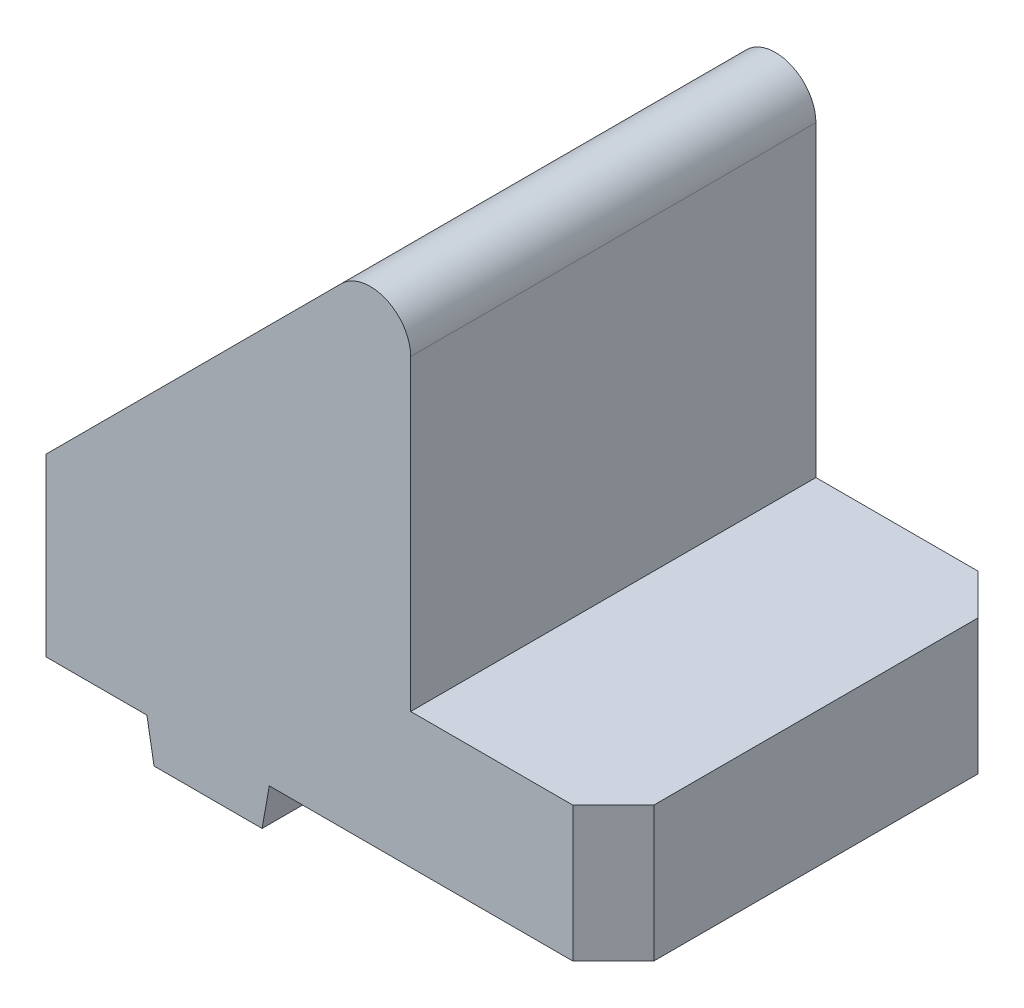
ISO-10303-21;
HEADER;
FILE_DESCRIPTION(('STEP AP214'),'2;1');
FILE_NAME('part.step','',(''),(''),'','','');
FILE_SCHEMA(('AUTOMOTIVE_DESIGN { 1 0 10303 214 1 1 1 1 }'));
ENDSEC;
DATA;
#1=APPLICATION_CONTEXT('core data for automotive mechanical design processes');
#2=APPLICATION_PROTOCOL_DEFINITION('international standard','automotive_design',2000,#1);
#3=PRODUCT_CONTEXT('',#1,'mechanical');
#4=PRODUCT('Part','Part','',(#3));
#5=PRODUCT_RELATED_PRODUCT_CATEGORY('part','',(#4));
#6=PRODUCT_DEFINITION_FORMATION('','',#4);
#7=PRODUCT_DEFINITION_CONTEXT('part definition',#1,'design');
#8=PRODUCT_DEFINITION('design','',#6,#7);
#9=PRODUCT_DEFINITION_SHAPE('','',#8);
#10=(LENGTH_UNIT() NAMED_UNIT(*) SI_UNIT(.MILLI.,.METRE.));
#11=(NAMED_UNIT(*) PLANE_ANGLE_UNIT() SI_UNIT($,.RADIAN.));
#12=(NAMED_UNIT(*) SI_UNIT($,.STERADIAN.) SOLID_ANGLE_UNIT());
#13=UNCERTAINTY_MEASURE_WITH_UNIT(LENGTH_MEASURE(1.E-05),#10,'distance_accuracy_value','');
#14=(GEOMETRIC_REPRESENTATION_CONTEXT(3) GLOBAL_UNCERTAINTY_ASSIGNED_CONTEXT((#13)) GLOBAL_UNIT_ASSIGNED_CONTEXT((#10,
#11,#12)) REPRESENTATION_CONTEXT('',''));
#15=CARTESIAN_POINT('',(0.,0.,0.));
#16=DIRECTION('',(0.,0.,1.));
#17=DIRECTION('',(1.,0.,0.));
#18=AXIS2_PLACEMENT_3D('',#15,#16,#17);
#19=CARTESIAN_POINT('',(15.,0.,15.));
#20=DIRECTION('',(0.,1.,0.));
#21=DIRECTION('',(-1.,0.,0.));
#22=AXIS2_PLACEMENT_3D('',#19,#20,#21);
#23=PLANE('',#22);
#24=DIRECTION('',(1.,0.,0.));
#25=VECTOR('',#24,1.);
#26=CARTESIAN_POINT('',(15.,0.,-15.));
#27=LINE('',#26,#25);
#28=CARTESIAN_POINT('',(-10.4710190578746,0.,-15.));
#29=VERTEX_POINT('',#28);
#30=CARTESIAN_POINT('',(12.,0.,-15.));
#31=VERTEX_POINT('',#30);
#32=EDGE_CURVE('E240',#29,#31,#27,.T.);
#33=ORIENTED_EDGE('',*,*,#32,.T.);
#34=DIRECTION('',(0.707106781186548,0.,0.707106781186547));
#35=VECTOR('',#34,1.);
#36=CARTESIAN_POINT('',(15.,0.,-12.));
#37=LINE('',#36,#35);
#38=CARTESIAN_POINT('',(15.,0.,-12.));
#39=VERTEX_POINT('',#38);
#40=EDGE_CURVE('E317',#31,#39,#37,.T.);
#41=ORIENTED_EDGE('',*,*,#40,.T.);
#42=DIRECTION('',(0.,0.,-1.));
#43=VECTOR('',#42,1.);
#44=CARTESIAN_POINT('',(15.,0.,15.));
#45=LINE('',#44,#43);
#46=CARTESIAN_POINT('',(15.,0.,12.));
#47=VERTEX_POINT('',#46);
#48=EDGE_CURVE('E290',#47,#39,#45,.T.);
#49=ORIENTED_EDGE('',*,*,#48,.F.);
#50=DIRECTION('',(0.707106781186546,0.,-0.707106781186549));
#51=VECTOR('',#50,1.);
#52=CARTESIAN_POINT('',(12.,0.,15.));
#53=LINE('',#52,#51);
#54=CARTESIAN_POINT('',(12.,0.,15.));
#55=VERTEX_POINT('',#54);
#56=EDGE_CURVE('E314',#47,#55,#53,.F.);
#57=ORIENTED_EDGE('',*,*,#56,.T.);
#58=DIRECTION('',(1.,0.,0.));
#59=VECTOR('',#58,1.);
#60=CARTESIAN_POINT('',(-10.4710190578746,0.,15.));
#61=LINE('',#60,#59);
#62=CARTESIAN_POINT('',(-10.4710190578746,0.,15.));
#63=VERTEX_POINT('',#62);
#64=EDGE_CURVE('E207',#63,#55,#61,.T.);
#65=ORIENTED_EDGE('',*,*,#64,.F.);
#66=DIRECTION('',(0.,0.,-1.));
#67=VECTOR('',#66,1.);
#68=CARTESIAN_POINT('',(-10.4710190578746,0.,15.));
#69=LINE('',#68,#67);
#70=EDGE_CURVE('E239',#63,#29,#69,.T.);
#71=ORIENTED_EDGE('',*,*,#70,.T.);
#72=EDGE_LOOP('',(#33,#41,#49,#57,#65,#71));
#73=FACE_BOUND('',#72,.T.);
#74=ADVANCED_FACE('F41',(#73),#23,.F.);
#75=CARTESIAN_POINT('',(15.,10.,15.));
#76=DIRECTION('',(-1.,0.,0.));
#77=DIRECTION('',(0.,-1.,0.));
#78=AXIS2_PLACEMENT_3D('',#75,#76,#77);
#79=PLANE('',#78);
#80=ORIENTED_EDGE('',*,*,#48,.T.);
#81=DIRECTION('',(0.,1.,0.));
#82=VECTOR('',#81,1.);
#83=CARTESIAN_POINT('',(15.,10.,-12.));
#84=LINE('',#83,#82);
#85=CARTESIAN_POINT('',(15.,10.,-12.));
#86=VERTEX_POINT('',#85);
#87=EDGE_CURVE('E297',#39,#86,#84,.T.);
#88=ORIENTED_EDGE('',*,*,#87,.T.);
#89=DIRECTION('',(0.,0.,-1.));
#90=VECTOR('',#89,1.);
#91=CARTESIAN_POINT('',(15.,10.,15.));
#92=LINE('',#91,#90);
#93=CARTESIAN_POINT('',(15.,10.,12.));
#94=VERTEX_POINT('',#93);
#95=EDGE_CURVE('E216',#94,#86,#92,.T.);
#96=ORIENTED_EDGE('',*,*,#95,.F.);
#97=DIRECTION('',(0.,-1.,0.));
#98=VECTOR('',#97,1.);
#99=CARTESIAN_POINT('',(15.,10.,12.));
#100=LINE('',#99,#98);
#101=EDGE_CURVE('E294',#94,#47,#100,.T.);
#102=ORIENTED_EDGE('',*,*,#101,.T.);
#103=EDGE_LOOP('',(#80,#88,#96,#102));
#104=FACE_BOUND('',#103,.T.);
#105=ADVANCED_FACE('F547',(#104),#79,.F.);
#106=CARTESIAN_POINT('',(0.,10.,15.));
#107=DIRECTION('',(0.,-1.,0.));
#108=DIRECTION('',(0.,0.,-1.));
#109=AXIS2_PLACEMENT_3D('',#106,#107,#108);
#110=PLANE('',#109);
#111=ORIENTED_EDGE('',*,*,#95,.T.);
#112=DIRECTION('',(-0.707106781186548,0.,-0.707106781186547));
#113=VECTOR('',#112,1.);
#114=CARTESIAN_POINT('',(15.,10.,-12.));
#115=LINE('',#114,#113);
#116=CARTESIAN_POINT('',(12.,10.,-15.));
#117=VERTEX_POINT('',#116);
#118=EDGE_CURVE('E304',#86,#117,#115,.T.);
#119=ORIENTED_EDGE('',*,*,#118,.T.);
#120=DIRECTION('',(-1.,0.,0.));
#121=VECTOR('',#120,1.);
#122=CARTESIAN_POINT('',(0.,10.,-15.));
#123=LINE('',#122,#121);
#124=CARTESIAN_POINT('',(0.,10.,-15.));
#125=VERTEX_POINT('',#124);
#126=EDGE_CURVE('E214',#117,#125,#123,.T.);
#127=ORIENTED_EDGE('',*,*,#126,.T.);
#128=DIRECTION('',(0.,0.,-1.));
#129=VECTOR('',#128,1.);
#130=CARTESIAN_POINT('',(0.,10.,15.));
#131=LINE('',#130,#129);
#132=CARTESIAN_POINT('',(0.,10.,15.));
#133=VERTEX_POINT('',#132);
#134=EDGE_CURVE('E210',#133,#125,#131,.T.);
#135=ORIENTED_EDGE('',*,*,#134,.F.);
#136=DIRECTION('',(-1.,0.,0.));
#137=VECTOR('',#136,1.);
#138=CARTESIAN_POINT('',(0.,10.,15.));
#139=LINE('',#138,#137);
#140=CARTESIAN_POINT('',(12.,10.,15.));
#141=VERTEX_POINT('',#140);
#142=EDGE_CURVE('E197',#141,#133,#139,.T.);
#143=ORIENTED_EDGE('',*,*,#142,.F.);
#144=DIRECTION('',(-0.707106781186546,0.,0.707106781186549));
#145=VECTOR('',#144,1.);
#146=CARTESIAN_POINT('',(12.,10.,15.));
#147=LINE('',#146,#145);
#148=EDGE_CURVE('E301',#141,#94,#147,.F.);
#149=ORIENTED_EDGE('',*,*,#148,.T.);
#150=EDGE_LOOP('',(#111,#119,#127,#135,#143,#149));
#151=FACE_BOUND('',#150,.T.);
#152=ADVANCED_FACE('F212',(#151),#110,.F.);
#153=CARTESIAN_POINT('',(0.,40.,15.));
#154=DIRECTION('',(-1.,0.,0.));
#155=DIRECTION('',(0.,-1.,0.));
#156=AXIS2_PLACEMENT_3D('',#153,#154,#155);
#157=PLANE('',#156);
#158=DIRECTION('',(0.,1.,0.));
#159=VECTOR('',#158,1.);
#160=CARTESIAN_POINT('',(0.,40.,-15.));
#161=LINE('',#160,#159);
#162=CARTESIAN_POINT('',(0.,32.7573593128807,-15.));
#163=VERTEX_POINT('',#162);
#164=EDGE_CURVE('E247',#125,#163,#161,.T.);
#165=ORIENTED_EDGE('',*,*,#164,.T.);
#166=DIRECTION('',(0.,0.,-1.));
#167=VECTOR('',#166,1.);
#168=CARTESIAN_POINT('',(0.,32.7573593128807,15.));
#169=LINE('',#168,#167);
#170=CARTESIAN_POINT('',(0.,32.7573593128807,15.));
#171=VERTEX_POINT('',#170);
#172=EDGE_CURVE('E50',#163,#171,#169,.F.);
#173=ORIENTED_EDGE('',*,*,#172,.T.);
#174=DIRECTION('',(0.,1.,0.));
#175=VECTOR('',#174,1.);
#176=CARTESIAN_POINT('',(0.,40.,15.));
#177=LINE('',#176,#175);
#178=EDGE_CURVE('E200',#133,#171,#177,.T.);
#179=ORIENTED_EDGE('',*,*,#178,.F.);
#180=ORIENTED_EDGE('',*,*,#134,.T.);
#181=EDGE_LOOP('',(#165,#173,#179,#180));
#182=FACE_BOUND('',#181,.T.);
#183=ADVANCED_FACE('F219',(#182),#157,.F.);
#184=CARTESIAN_POINT('',(-30.,9.99999999999999,15.));
#185=DIRECTION('',(0.707106781186548,-0.707106781186547,0.));
#186=DIRECTION('',(0.707106781186547,0.707106781186548,0.));
#187=AXIS2_PLACEMENT_3D('',#184,#185,#186);
#188=PLANE('',#187);
#189=DIRECTION('',(0.,0.,1.));
#190=VECTOR('',#189,1.);
#191=CARTESIAN_POINT('',(-6.99999999999318,33.0000000000068,15.));
#192=LINE('',#191,#190);
#193=CARTESIAN_POINT('',(-6.99999999999317,33.0000000000068,-4.99999999999998));
#194=VERTEX_POINT('',#193);
#195=CARTESIAN_POINT('',(-6.99999999999318,33.0000000000068,5.00000000000001));
#196=VERTEX_POINT('',#195);
#197=EDGE_CURVE('E350',#194,#196,#192,.T.);
#198=ORIENTED_EDGE('',*,*,#197,.T.);
#199=DIRECTION('',(0.577350269189628,0.577350269189628,-0.577350269189621));
#200=VECTOR('',#199,1.);
#201=CARTESIAN_POINT('',(-25.6666666666645,14.3333333333355,23.6666666666711));
#202=LINE('',#201,#200);
#203=CARTESIAN_POINT('',(-9.9999999999932,30.0000000000068,8.));
#204=VERTEX_POINT('',#203);
#205=EDGE_CURVE('E405',#196,#204,#202,.F.);
#206=ORIENTED_EDGE('',*,*,#205,.T.);
#207=DIRECTION('',(-0.707106781186547,-0.707106781186548,0.));
#208=VECTOR('',#207,1.);
#209=CARTESIAN_POINT('',(-30.,10.,7.99999999999999));
#210=LINE('',#209,#208);
#211=CARTESIAN_POINT('',(-19.9999999999932,20.0000000000068,7.99999999999999));
#212=VERTEX_POINT('',#211);
#213=EDGE_CURVE('E354',#204,#212,#210,.T.);
#214=ORIENTED_EDGE('',*,*,#213,.T.);
#215=DIRECTION('',(0.577350269189624,0.577350269189624,0.57735026918963));
#216=VECTOR('',#215,1.);
#217=CARTESIAN_POINT('',(-24.333333333331,15.666666666669,3.66666666666214));
#218=LINE('',#217,#216);
#219=CARTESIAN_POINT('',(-22.9999999999932,17.0000000000068,4.99999999999998));
#220=VERTEX_POINT('',#219);
#221=EDGE_CURVE('E402',#212,#220,#218,.F.);
#222=ORIENTED_EDGE('',*,*,#221,.T.);
#223=DIRECTION('',(0.,0.,-1.));
#224=VECTOR('',#223,1.);
#225=CARTESIAN_POINT('',(-22.9999999999932,17.0000000000068,15.));
#226=LINE('',#225,#224);
#227=CARTESIAN_POINT('',(-22.9999999999932,17.0000000000068,-5.));
#228=VERTEX_POINT('',#227);
#229=EDGE_CURVE('E358',#220,#228,#226,.T.);
#230=ORIENTED_EDGE('',*,*,#229,.T.);
#231=DIRECTION('',(-0.577350269189627,-0.577350269189628,0.577350269189622));
#232=VECTOR('',#231,1.);
#233=CARTESIAN_POINT('',(-34.3333333333311,5.66666666666893,6.33333333333779));
#234=LINE('',#233,#232);
#235=CARTESIAN_POINT('',(-19.9999999999931,20.0000000000069,-8.00000000000001));
#236=VERTEX_POINT('',#235);
#237=EDGE_CURVE('E411',#228,#236,#234,.F.);
#238=ORIENTED_EDGE('',*,*,#237,.T.);
#239=DIRECTION('',(0.707106781186547,0.707106781186548,0.));
#240=VECTOR('',#239,1.);
#241=CARTESIAN_POINT('',(-30.,10.,-8.00000000000001));
#242=LINE('',#241,#240);
#243=CARTESIAN_POINT('',(-9.99999999999317,30.0000000000068,-8.));
#244=VERTEX_POINT('',#243);
#245=EDGE_CURVE('E346',#236,#244,#242,.T.);
#246=ORIENTED_EDGE('',*,*,#245,.T.);
#247=DIRECTION('',(-0.577350269189624,-0.577350269189624,-0.57735026918963));
#248=VECTOR('',#247,1.);
#249=CARTESIAN_POINT('',(-15.6666666666642,24.3333333333357,-13.6666666666712));
#250=LINE('',#249,#248);
#251=EDGE_CURVE('E408',#244,#194,#250,.F.);
#252=ORIENTED_EDGE('',*,*,#251,.T.);
#253=EDGE_LOOP('',(#198,#206,#214,#222,#230,#238,#246,#252));
#254=FACE_BOUND('',#253,.T.);
#255=DIRECTION('',(-0.707106781186547,-0.707106781186548,0.));
#256=VECTOR('',#255,1.);
#257=CARTESIAN_POINT('',(-30.,9.99999999999999,15.));
#258=LINE('',#257,#256);
#259=CARTESIAN_POINT('',(-5.12132034355965,34.8786796564403,15.));
#260=VERTEX_POINT('',#259);
#261=CARTESIAN_POINT('',(-27.,13.,15.));
#262=VERTEX_POINT('',#261);
#263=EDGE_CURVE('E221',#260,#262,#258,.T.);
#264=ORIENTED_EDGE('',*,*,#263,.F.);
#265=DIRECTION('',(0.,0.,-1.));
#266=VECTOR('',#265,1.);
#267=CARTESIAN_POINT('',(-5.12132034355964,34.8786796564404,15.));
#268=LINE('',#267,#266);
#269=CARTESIAN_POINT('',(-5.12132034355965,34.8786796564403,-15.));
#270=VERTEX_POINT('',#269);
#271=EDGE_CURVE('E414',#260,#270,#268,.T.);
#272=ORIENTED_EDGE('',*,*,#271,.T.);
#273=DIRECTION('',(-0.707106781186547,-0.707106781186548,0.));
#274=VECTOR('',#273,1.);
#275=CARTESIAN_POINT('',(-30.,9.99999999999999,-15.));
#276=LINE('',#275,#274);
#277=CARTESIAN_POINT('',(-27.,13.,-15.));
#278=VERTEX_POINT('',#277);
#279=EDGE_CURVE('E250',#270,#278,#276,.T.);
#280=ORIENTED_EDGE('',*,*,#279,.T.);
#281=DIRECTION('',(-0.577350269189626,-0.577350269189626,0.577350269189625));
#282=VECTOR('',#281,1.);
#283=CARTESIAN_POINT('',(-33.3333333333333,6.66666666666666,-8.66666666666667));
#284=LINE('',#283,#282);
#285=CARTESIAN_POINT('',(-30.,9.99999999999999,-12.));
#286=VERTEX_POINT('',#285);
#287=EDGE_CURVE('E339',#278,#286,#284,.T.);
#288=ORIENTED_EDGE('',*,*,#287,.T.);
#289=DIRECTION('',(0.,0.,-1.));
#290=VECTOR('',#289,1.);
#291=CARTESIAN_POINT('',(-30.,9.99999999999999,15.));
#292=LINE('',#291,#290);
#293=CARTESIAN_POINT('',(-30.,9.99999999999999,12.));
#294=VERTEX_POINT('',#293);
#295=EDGE_CURVE('E217',#294,#286,#292,.T.);
#296=ORIENTED_EDGE('',*,*,#295,.F.);
#297=DIRECTION('',(-0.577350269189625,-0.577350269189625,-0.577350269189627));
#298=VECTOR('',#297,1.);
#299=CARTESIAN_POINT('',(-31.3333333333333,8.66666666666667,10.6666666666667));
#300=LINE('',#299,#298);
#301=EDGE_CURVE('E342',#294,#262,#300,.F.);
#302=ORIENTED_EDGE('',*,*,#301,.T.);
#303=EDGE_LOOP('',(#264,#272,#280,#288,#296,#302));
#304=FACE_BOUND('',#303,.T.);
#305=ADVANCED_FACE('F423',(#254,#304),#188,.F.);
#306=CARTESIAN_POINT('',(-30.,0.,15.));
#307=DIRECTION('',(1.,0.,0.));
#308=DIRECTION('',(0.,0.,-1.));
#309=AXIS2_PLACEMENT_3D('',#306,#307,#308);
#310=PLANE('',#309);
#311=DIRECTION('',(0.,0.,-1.));
#312=VECTOR('',#311,1.);
#313=CARTESIAN_POINT('',(-30.,0.,15.));
#314=LINE('',#313,#312);
#315=CARTESIAN_POINT('',(-30.,0.,12.));
#316=VERTEX_POINT('',#315);
#317=CARTESIAN_POINT('',(-30.,0.,-12.));
#318=VERTEX_POINT('',#317);
#319=EDGE_CURVE('E281',#316,#318,#314,.T.);
#320=ORIENTED_EDGE('',*,*,#319,.F.);
#321=DIRECTION('',(0.,1.,0.));
#322=VECTOR('',#321,1.);
#323=CARTESIAN_POINT('',(-30.,0.,12.));
#324=LINE('',#323,#322);
#325=EDGE_CURVE('E336',#316,#294,#324,.T.);
#326=ORIENTED_EDGE('',*,*,#325,.T.);
#327=ORIENTED_EDGE('',*,*,#295,.T.);
#328=DIRECTION('',(0.,-1.,0.));
#329=VECTOR('',#328,1.);
#330=CARTESIAN_POINT('',(-30.,0.,-12.));
#331=LINE('',#330,#329);
#332=EDGE_CURVE('E332',#286,#318,#331,.T.);
#333=ORIENTED_EDGE('',*,*,#332,.T.);
#334=EDGE_LOOP('',(#320,#326,#327,#333));
#335=FACE_BOUND('',#334,.T.);
#336=ADVANCED_FACE('F437',(#335),#310,.F.);
#337=CARTESIAN_POINT('',(-19.5289809421254,0.,15.));
#338=DIRECTION('',(0.,1.,0.));
#339=DIRECTION('',(-1.,0.,0.));
#340=AXIS2_PLACEMENT_3D('',#337,#338,#339);
#341=PLANE('',#340);
#342=DIRECTION('',(1.,0.,0.));
#343=VECTOR('',#342,1.);
#344=CARTESIAN_POINT('',(-19.5289809421254,0.,15.));
#345=LINE('',#344,#343);
#346=CARTESIAN_POINT('',(-27.,0.,15.));
#347=VERTEX_POINT('',#346);
#348=CARTESIAN_POINT('',(-19.5289809421254,0.,15.));
#349=VERTEX_POINT('',#348);
#350=EDGE_CURVE('E224',#347,#349,#345,.T.);
#351=ORIENTED_EDGE('',*,*,#350,.F.);
#352=DIRECTION('',(0.707106781186547,0.,0.707106781186548));
#353=VECTOR('',#352,1.);
#354=CARTESIAN_POINT('',(-27.,0.,15.));
#355=LINE('',#354,#353);
#356=EDGE_CURVE('E329',#347,#316,#355,.F.);
#357=ORIENTED_EDGE('',*,*,#356,.T.);
#358=ORIENTED_EDGE('',*,*,#319,.T.);
#359=DIRECTION('',(0.707106781186548,0.,-0.707106781186547));
#360=VECTOR('',#359,1.);
#361=CARTESIAN_POINT('',(-30.,0.,-12.));
#362=LINE('',#361,#360);
#363=CARTESIAN_POINT('',(-27.,0.,-15.));
#364=VERTEX_POINT('',#363);
#365=EDGE_CURVE('E326',#318,#364,#362,.T.);
#366=ORIENTED_EDGE('',*,*,#365,.T.);
#367=DIRECTION('',(1.,0.,0.));
#368=VECTOR('',#367,1.);
#369=CARTESIAN_POINT('',(-19.5289809421254,0.,-15.));
#370=LINE('',#369,#368);
#371=CARTESIAN_POINT('',(-19.5289809421254,0.,-15.));
#372=VERTEX_POINT('',#371);
#373=EDGE_CURVE('E253',#364,#372,#370,.T.);
#374=ORIENTED_EDGE('',*,*,#373,.T.);
#375=DIRECTION('',(0.,0.,-1.));
#376=VECTOR('',#375,1.);
#377=CARTESIAN_POINT('',(-19.5289809421254,0.,15.));
#378=LINE('',#377,#376);
#379=EDGE_CURVE('E277',#349,#372,#378,.T.);
#380=ORIENTED_EDGE('',*,*,#379,.F.);
#381=EDGE_LOOP('',(#351,#357,#358,#366,#374,#380));
#382=FACE_BOUND('',#381,.T.);
#383=ADVANCED_FACE('F445',(#382),#341,.F.);
#384=CARTESIAN_POINT('',(-19.,-3.,15.));
#385=DIRECTION('',(0.984807753012207,0.173648177666934,0.));
#386=DIRECTION('',(-0.173648177666934,0.984807753012207,0.));
#387=AXIS2_PLACEMENT_3D('',#384,#385,#386);
#388=PLANE('',#387);
#389=DIRECTION('',(0.173648177666934,-0.984807753012207,0.));
#390=VECTOR('',#389,1.);
#391=CARTESIAN_POINT('',(-19.,-3.,-15.));
#392=LINE('',#391,#390);
#393=CARTESIAN_POINT('',(-19.,-3.,-15.));
#394=VERTEX_POINT('',#393);
#395=EDGE_CURVE('E256',#372,#394,#392,.T.);
#396=ORIENTED_EDGE('',*,*,#395,.T.);
#397=DIRECTION('',(0.,0.,-1.));
#398=VECTOR('',#397,1.);
#399=CARTESIAN_POINT('',(-19.,-3.,15.));
#400=LINE('',#399,#398);
#401=CARTESIAN_POINT('',(-19.,-3.,15.));
#402=VERTEX_POINT('',#401);
#403=EDGE_CURVE('E273',#402,#394,#400,.T.);
#404=ORIENTED_EDGE('',*,*,#403,.F.);
#405=DIRECTION('',(0.173648177666934,-0.984807753012207,0.));
#406=VECTOR('',#405,1.);
#407=CARTESIAN_POINT('',(-19.,-3.,15.));
#408=LINE('',#407,#406);
#409=EDGE_CURVE('E230',#349,#402,#408,.T.);
#410=ORIENTED_EDGE('',*,*,#409,.F.);
#411=ORIENTED_EDGE('',*,*,#379,.T.);
#412=EDGE_LOOP('',(#396,#404,#410,#411));
#413=FACE_BOUND('',#412,.T.);
#414=ADVANCED_FACE('F449',(#413),#388,.F.);
#415=CARTESIAN_POINT('',(-19.,-3.,15.));
#416=DIRECTION('',(0.,1.,0.));
#417=DIRECTION('',(0.,0.,1.));
#418=AXIS2_PLACEMENT_3D('',#415,#416,#417);
#419=PLANE('',#418);
#420=CARTESIAN_POINT('',(-14.9999999999932,-3.00000000000001,0.));
#421=DIRECTION('',(0.,1.,0.));
#422=DIRECTION('',(-1.,0.,0.));
#423=AXIS2_PLACEMENT_3D('',#420,#421,#422);
#424=CIRCLE('',#423,3.2);
#425=CARTESIAN_POINT('',(-18.1999999999932,-3.00000000000001,0.));
#426=VERTEX_POINT('',#425);
#427=EDGE_CURVE('E481',#426,#426,#424,.T.);
#428=ORIENTED_EDGE('',*,*,#427,.T.);
#429=EDGE_LOOP('',(#428));
#430=FACE_BOUND('',#429,.T.);
#431=DIRECTION('',(1.,0.,0.));
#432=VECTOR('',#431,1.);
#433=CARTESIAN_POINT('',(-19.,-3.,-15.));
#434=LINE('',#433,#432);
#435=CARTESIAN_POINT('',(-11.,-3.,-15.));
#436=VERTEX_POINT('',#435);
#437=EDGE_CURVE('E259',#394,#436,#434,.T.);
#438=ORIENTED_EDGE('',*,*,#437,.T.);
#439=DIRECTION('',(0.,0.,-1.));
#440=VECTOR('',#439,1.);
#441=CARTESIAN_POINT('',(-11.,-3.,15.));
#442=LINE('',#441,#440);
#443=CARTESIAN_POINT('',(-11.,-3.,15.));
#444=VERTEX_POINT('',#443);
#445=EDGE_CURVE('E269',#444,#436,#442,.T.);
#446=ORIENTED_EDGE('',*,*,#445,.F.);
#447=DIRECTION('',(1.,0.,0.));
#448=VECTOR('',#447,1.);
#449=CARTESIAN_POINT('',(-19.,-3.,15.));
#450=LINE('',#449,#448);
#451=EDGE_CURVE('E233',#402,#444,#450,.T.);
#452=ORIENTED_EDGE('',*,*,#451,.F.);
#453=ORIENTED_EDGE('',*,*,#403,.T.);
#454=EDGE_LOOP('',(#438,#446,#452,#453));
#455=FACE_BOUND('',#454,.T.);
#456=ADVANCED_FACE('F455',(#430,#455),#419,.F.);
#457=CARTESIAN_POINT('',(-10.4710190578746,0.,15.));
#458=DIRECTION('',(-0.984807753012207,0.173648177666935,0.));
#459=DIRECTION('',(-0.173648177666935,-0.984807753012207,0.));
#460=AXIS2_PLACEMENT_3D('',#457,#458,#459);
#461=PLANE('',#460);
#462=DIRECTION('',(0.173648177666935,0.984807753012207,0.));
#463=VECTOR('',#462,1.);
#464=CARTESIAN_POINT('',(-10.4710190578746,0.,-15.));
#465=LINE('',#464,#463);
#466=EDGE_CURVE('E262',#436,#29,#465,.T.);
#467=ORIENTED_EDGE('',*,*,#466,.T.);
#468=ORIENTED_EDGE('',*,*,#70,.F.);
#469=DIRECTION('',(0.173648177666935,0.984807753012207,0.));
#470=VECTOR('',#469,1.);
#471=CARTESIAN_POINT('',(-10.4710190578746,0.,15.));
#472=LINE('',#471,#470);
#473=EDGE_CURVE('E236',#444,#63,#472,.T.);
#474=ORIENTED_EDGE('',*,*,#473,.F.);
#475=ORIENTED_EDGE('',*,*,#445,.T.);
#476=EDGE_LOOP('',(#467,#468,#474,#475));
#477=FACE_BOUND('',#476,.T.);
#478=ADVANCED_FACE('F459',(#477),#461,.F.);
#479=CARTESIAN_POINT('',(0.,0.,15.));
#480=DIRECTION('',(0.,0.,-1.));
#481=DIRECTION('',(-1.,0.,0.));
#482=AXIS2_PLACEMENT_3D('',#479,#480,#481);
#483=PLANE('',#482);
#484=ORIENTED_EDGE('',*,*,#178,.T.);
#485=CARTESIAN_POINT('',(-3.,32.7573593128807,15.));
#486=DIRECTION('',(0.,0.,-1.));
#487=DIRECTION('',(-1.,0.,0.));
#488=AXIS2_PLACEMENT_3D('',#485,#486,#487);
#489=CIRCLE('',#488,3.);
#490=EDGE_CURVE('E11',#171,#260,#489,.F.);
#491=ORIENTED_EDGE('',*,*,#490,.T.);
#492=ORIENTED_EDGE('',*,*,#263,.T.);
#493=DIRECTION('',(0.,-1.,0.));
#494=VECTOR('',#493,1.);
#495=CARTESIAN_POINT('',(-27.,0.,15.));
#496=LINE('',#495,#494);
#497=EDGE_CURVE('E320',#262,#347,#496,.T.);
#498=ORIENTED_EDGE('',*,*,#497,.T.);
#499=ORIENTED_EDGE('',*,*,#350,.T.);
#500=ORIENTED_EDGE('',*,*,#409,.T.);
#501=ORIENTED_EDGE('',*,*,#451,.T.);
#502=ORIENTED_EDGE('',*,*,#473,.T.);
#503=ORIENTED_EDGE('',*,*,#64,.T.);
#504=DIRECTION('',(0.,1.,0.));
#505=VECTOR('',#504,1.);
#506=CARTESIAN_POINT('',(12.,0.,15.));
#507=LINE('',#506,#505);
#508=EDGE_CURVE('E204',#55,#141,#507,.T.);
#509=ORIENTED_EDGE('',*,*,#508,.T.);
#510=ORIENTED_EDGE('',*,*,#142,.T.);
#511=EDGE_LOOP('',(#484,#491,#492,#498,#499,#500,#501,#502,#503,#509,#510));
#512=FACE_BOUND('',#511,.T.);
#513=ADVANCED_FACE('F199',(#512),#483,.F.);
#514=CARTESIAN_POINT('',(0.,0.,-15.));
#515=DIRECTION('',(0.,0.,-1.));
#516=DIRECTION('',(-1.,0.,0.));
#517=AXIS2_PLACEMENT_3D('',#514,#515,#516);
#518=PLANE('',#517);
#519=ORIENTED_EDGE('',*,*,#279,.F.);
#520=CARTESIAN_POINT('',(-3.,32.7573593128807,-15.));
#521=DIRECTION('',(0.,0.,-1.));
#522=DIRECTION('',(-1.,0.,0.));
#523=AXIS2_PLACEMENT_3D('',#520,#521,#522);
#524=CIRCLE('',#523,3.);
#525=EDGE_CURVE('E64',#270,#163,#524,.T.);
#526=ORIENTED_EDGE('',*,*,#525,.T.);
#527=ORIENTED_EDGE('',*,*,#164,.F.);
#528=ORIENTED_EDGE('',*,*,#126,.F.);
#529=DIRECTION('',(0.,-1.,0.));
#530=VECTOR('',#529,1.);
#531=CARTESIAN_POINT('',(12.,0.,-15.));
#532=LINE('',#531,#530);
#533=EDGE_CURVE('E311',#117,#31,#532,.T.);
#534=ORIENTED_EDGE('',*,*,#533,.T.);
#535=ORIENTED_EDGE('',*,*,#32,.F.);
#536=ORIENTED_EDGE('',*,*,#466,.F.);
#537=ORIENTED_EDGE('',*,*,#437,.F.);
#538=ORIENTED_EDGE('',*,*,#395,.F.);
#539=ORIENTED_EDGE('',*,*,#373,.F.);
#540=DIRECTION('',(0.,1.,0.));
#541=VECTOR('',#540,1.);
#542=CARTESIAN_POINT('',(-27.,9.99999999999999,-15.));
#543=LINE('',#542,#541);
#544=EDGE_CURVE('E307',#364,#278,#543,.T.);
#545=ORIENTED_EDGE('',*,*,#544,.T.);
#546=EDGE_LOOP('',(#519,#526,#527,#528,#534,#535,#536,#537,#538,#539,#545));
#547=FACE_BOUND('',#546,.T.);
#548=ADVANCED_FACE('F425',(#547),#518,.T.);
#549=CARTESIAN_POINT('',(15.,10.,-12.));
#550=DIRECTION('',(0.707106781186547,0.,-0.707106781186548));
#551=DIRECTION('',(0.,-1.,0.));
#552=AXIS2_PLACEMENT_3D('',#549,#550,#551);
#553=PLANE('',#552);
#554=ORIENTED_EDGE('',*,*,#40,.F.);
#555=ORIENTED_EDGE('',*,*,#533,.F.);
#556=ORIENTED_EDGE('',*,*,#118,.F.);
#557=ORIENTED_EDGE('',*,*,#87,.F.);
#558=EDGE_LOOP('',(#554,#555,#556,#557));
#559=FACE_BOUND('',#558,.T.);
#560=ADVANCED_FACE('F557',(#559),#553,.T.);
#561=CARTESIAN_POINT('',(12.,0.,15.));
#562=DIRECTION('',(-0.707106781186549,0.,-0.707106781186546));
#563=DIRECTION('',(0.,1.,0.));
#564=AXIS2_PLACEMENT_3D('',#561,#562,#563);
#565=PLANE('',#564);
#566=ORIENTED_EDGE('',*,*,#56,.F.);
#567=ORIENTED_EDGE('',*,*,#101,.F.);
#568=ORIENTED_EDGE('',*,*,#148,.F.);
#569=ORIENTED_EDGE('',*,*,#508,.F.);
#570=EDGE_LOOP('',(#566,#567,#568,#569));
#571=FACE_BOUND('',#570,.T.);
#572=ADVANCED_FACE('F563',(#571),#565,.F.);
#573=CARTESIAN_POINT('',(-27.,0.,15.));
#574=DIRECTION('',(0.707106781186548,0.,-0.707106781186547));
#575=DIRECTION('',(0.,-1.,0.));
#576=AXIS2_PLACEMENT_3D('',#573,#574,#575);
#577=PLANE('',#576);
#578=ORIENTED_EDGE('',*,*,#301,.F.);
#579=ORIENTED_EDGE('',*,*,#325,.F.);
#580=ORIENTED_EDGE('',*,*,#356,.F.);
#581=ORIENTED_EDGE('',*,*,#497,.F.);
#582=EDGE_LOOP('',(#578,#579,#580,#581));
#583=FACE_BOUND('',#582,.T.);
#584=ADVANCED_FACE('F440',(#583),#577,.F.);
#585=CARTESIAN_POINT('',(-30.,0.,-12.));
#586=DIRECTION('',(-0.707106781186547,0.,-0.707106781186548));
#587=DIRECTION('',(0.,1.,0.));
#588=AXIS2_PLACEMENT_3D('',#585,#586,#587);
#589=PLANE('',#588);
#590=ORIENTED_EDGE('',*,*,#287,.F.);
#591=ORIENTED_EDGE('',*,*,#544,.F.);
#592=ORIENTED_EDGE('',*,*,#365,.F.);
#593=ORIENTED_EDGE('',*,*,#332,.F.);
#594=EDGE_LOOP('',(#590,#591,#592,#593));
#595=FACE_BOUND('',#594,.T.);
#596=ADVANCED_FACE('F432',(#595),#589,.T.);
#597=CARTESIAN_POINT('',(-22.9999999999932,40.,7.99999999999999));
#598=DIRECTION('',(-1.,0.,0.));
#599=DIRECTION('',(0.,-1.,0.));
#600=AXIS2_PLACEMENT_3D('',#597,#598,#599);
#601=PLANE('',#600);
#602=ORIENTED_EDGE('',*,*,#229,.F.);
#603=DIRECTION('',(0.,-1.,0.));
#604=VECTOR('',#603,1.);
#605=CARTESIAN_POINT('',(-22.9999999999932,10.,4.99999999999998));
#606=LINE('',#605,#604);
#607=CARTESIAN_POINT('',(-22.9999999999932,10.,4.99999999999998));
#608=VERTEX_POINT('',#607);
#609=EDGE_CURVE('E365',#220,#608,#606,.T.);
#610=ORIENTED_EDGE('',*,*,#609,.T.);
#611=DIRECTION('',(0.,0.,-1.));
#612=VECTOR('',#611,1.);
#613=CARTESIAN_POINT('',(-22.9999999999932,10.,7.99999999999999));
#614=LINE('',#613,#612);
#615=CARTESIAN_POINT('',(-22.9999999999932,10.,-5.));
#616=VERTEX_POINT('',#615);
#617=EDGE_CURVE('E477',#608,#616,#614,.T.);
#618=ORIENTED_EDGE('',*,*,#617,.T.);
#619=DIRECTION('',(0.,1.,0.));
#620=VECTOR('',#619,1.);
#621=CARTESIAN_POINT('',(-22.9999999999932,17.0000000000068,-5.));
#622=LINE('',#621,#620);
#623=EDGE_CURVE('E362',#616,#228,#622,.T.);
#624=ORIENTED_EDGE('',*,*,#623,.T.);
#625=EDGE_LOOP('',(#602,#610,#618,#624));
#626=FACE_BOUND('',#625,.T.);
#627=ADVANCED_FACE('F510',(#626),#601,.F.);
#628=CARTESIAN_POINT('',(-6.99999999999318,40.,8.));
#629=DIRECTION('',(0.,0.,1.));
#630=DIRECTION('',(1.,0.,0.));
#631=AXIS2_PLACEMENT_3D('',#628,#629,#630);
#632=PLANE('',#631);
#633=DIRECTION('',(-1.,0.,0.));
#634=VECTOR('',#633,1.);
#635=CARTESIAN_POINT('',(-6.99999999999317,10.,8.));
#636=LINE('',#635,#634);
#637=CARTESIAN_POINT('',(-9.9999999999932,10.,7.99999999999999));
#638=VERTEX_POINT('',#637);
#639=CARTESIAN_POINT('',(-19.9999999999932,10.,7.99999999999999));
#640=VERTEX_POINT('',#639);
#641=EDGE_CURVE('E244',#638,#640,#636,.T.);
#642=ORIENTED_EDGE('',*,*,#641,.T.);
#643=DIRECTION('',(0.,1.,0.));
#644=VECTOR('',#643,1.);
#645=CARTESIAN_POINT('',(-19.9999999999932,17.0000000000068,7.99999999999999));
#646=LINE('',#645,#644);
#647=EDGE_CURVE('E385',#640,#212,#646,.T.);
#648=ORIENTED_EDGE('',*,*,#647,.T.);
#649=ORIENTED_EDGE('',*,*,#213,.F.);
#650=DIRECTION('',(0.,-1.,0.));
#651=VECTOR('',#650,1.);
#652=CARTESIAN_POINT('',(-9.9999999999932,10.,7.99999999999999));
#653=LINE('',#652,#651);
#654=EDGE_CURVE('E381',#204,#638,#653,.T.);
#655=ORIENTED_EDGE('',*,*,#654,.T.);
#656=EDGE_LOOP('',(#642,#648,#649,#655));
#657=FACE_BOUND('',#656,.T.);
#658=ADVANCED_FACE('F535',(#657),#632,.F.);
#659=CARTESIAN_POINT('',(-6.99999999999318,40.,8.));
#660=DIRECTION('',(1.,0.,0.));
#661=DIRECTION('',(0.,0.,-1.));
#662=AXIS2_PLACEMENT_3D('',#659,#660,#661);
#663=PLANE('',#662);
#664=DIRECTION('',(0.,0.,1.));
#665=VECTOR('',#664,1.);
#666=CARTESIAN_POINT('',(-6.99999999999317,10.,8.));
#667=LINE('',#666,#665);
#668=CARTESIAN_POINT('',(-6.99999999999317,10.,-4.99999999999998));
#669=VERTEX_POINT('',#668);
#670=CARTESIAN_POINT('',(-6.99999999999317,10.,5.00000000000001));
#671=VERTEX_POINT('',#670);
#672=EDGE_CURVE('E469',#669,#671,#667,.T.);
#673=ORIENTED_EDGE('',*,*,#672,.T.);
#674=DIRECTION('',(0.,1.,0.));
#675=VECTOR('',#674,1.);
#676=CARTESIAN_POINT('',(-6.99999999999318,33.0000000000068,5.00000000000001));
#677=LINE('',#676,#675);
#678=EDGE_CURVE('E392',#671,#196,#677,.T.);
#679=ORIENTED_EDGE('',*,*,#678,.T.);
#680=ORIENTED_EDGE('',*,*,#197,.F.);
#681=DIRECTION('',(0.,-1.,0.));
#682=VECTOR('',#681,1.);
#683=CARTESIAN_POINT('',(-6.99999999999317,10.,-4.99999999999998));
#684=LINE('',#683,#682);
#685=EDGE_CURVE('E388',#194,#669,#684,.T.);
#686=ORIENTED_EDGE('',*,*,#685,.T.);
#687=EDGE_LOOP('',(#673,#679,#680,#686));
#688=FACE_BOUND('',#687,.T.);
#689=ADVANCED_FACE('F526',(#688),#663,.F.);
#690=CARTESIAN_POINT('',(-6.99999999999317,40.,-8.00000000000001));
#691=DIRECTION('',(0.,0.,-1.));
#692=DIRECTION('',(-1.,0.,0.));
#693=AXIS2_PLACEMENT_3D('',#690,#691,#692);
#694=PLANE('',#693);
#695=DIRECTION('',(1.,0.,0.));
#696=VECTOR('',#695,1.);
#697=CARTESIAN_POINT('',(-6.99999999999317,10.,-8.00000000000001));
#698=LINE('',#697,#696);
#699=CARTESIAN_POINT('',(-19.9999999999931,10.,-8.00000000000001));
#700=VERTEX_POINT('',#699);
#701=CARTESIAN_POINT('',(-9.99999999999316,10.,-8.00000000000001));
#702=VERTEX_POINT('',#701);
#703=EDGE_CURVE('E473',#700,#702,#698,.T.);
#704=ORIENTED_EDGE('',*,*,#703,.T.);
#705=DIRECTION('',(0.,1.,0.));
#706=VECTOR('',#705,1.);
#707=CARTESIAN_POINT('',(-9.99999999999317,33.0000000000068,-8.00000000000001));
#708=LINE('',#707,#706);
#709=EDGE_CURVE('E399',#702,#244,#708,.T.);
#710=ORIENTED_EDGE('',*,*,#709,.T.);
#711=ORIENTED_EDGE('',*,*,#245,.F.);
#712=DIRECTION('',(0.,-1.,0.));
#713=VECTOR('',#712,1.);
#714=CARTESIAN_POINT('',(-19.9999999999931,10.,-8.00000000000001));
#715=LINE('',#714,#713);
#716=EDGE_CURVE('E395',#236,#700,#715,.T.);
#717=ORIENTED_EDGE('',*,*,#716,.T.);
#718=EDGE_LOOP('',(#704,#710,#711,#717));
#719=FACE_BOUND('',#718,.T.);
#720=ADVANCED_FACE('F502',(#719),#694,.F.);
#721=CARTESIAN_POINT('',(0.,10.,0.));
#722=DIRECTION('',(0.,1.,0.));
#723=DIRECTION('',(-1.,0.,0.));
#724=AXIS2_PLACEMENT_3D('',#721,#722,#723);
#725=PLANE('',#724);
#726=CARTESIAN_POINT('',(-14.9999999999932,10.,0.));
#727=DIRECTION('',(0.,1.,0.));
#728=DIRECTION('',(-1.,0.,0.));
#729=AXIS2_PLACEMENT_3D('',#726,#727,#728);
#730=CIRCLE('',#729,3.2);
#731=CARTESIAN_POINT('',(-18.1999999999932,10.,0.));
#732=VERTEX_POINT('',#731);
#733=EDGE_CURVE('E482',#732,#732,#730,.T.);
#734=ORIENTED_EDGE('',*,*,#733,.F.);
#735=EDGE_LOOP('',(#734));
#736=FACE_BOUND('',#735,.T.);
#737=ORIENTED_EDGE('',*,*,#617,.F.);
#738=DIRECTION('',(-0.707106781186543,0.,-0.707106781186552));
#739=VECTOR('',#738,1.);
#740=CARTESIAN_POINT('',(-13.9999999999967,10.,13.9999999999965));
#741=LINE('',#740,#739);
#742=EDGE_CURVE('E378',#608,#640,#741,.F.);
#743=ORIENTED_EDGE('',*,*,#742,.T.);
#744=ORIENTED_EDGE('',*,*,#641,.F.);
#745=DIRECTION('',(-0.707106781186552,0.,0.707106781186543));
#746=VECTOR('',#745,1.);
#747=CARTESIAN_POINT('',(-0.999999999996539,10.,-0.99999999999655));
#748=LINE('',#747,#746);
#749=EDGE_CURVE('E375',#638,#671,#748,.F.);
#750=ORIENTED_EDGE('',*,*,#749,.T.);
#751=ORIENTED_EDGE('',*,*,#672,.F.);
#752=DIRECTION('',(0.707106781186543,0.,0.707106781186552));
#753=VECTOR('',#752,1.);
#754=CARTESIAN_POINT('',(-0.999999999996639,10.,0.999999999996626));
#755=LINE('',#754,#753);
#756=EDGE_CURVE('E372',#669,#702,#755,.F.);
#757=ORIENTED_EDGE('',*,*,#756,.T.);
#758=ORIENTED_EDGE('',*,*,#703,.F.);
#759=DIRECTION('',(0.707106781186551,0.,-0.707106781186544));
#760=VECTOR('',#759,1.);
#761=CARTESIAN_POINT('',(-13.9999999999965,10.,-13.9999999999966));
#762=LINE('',#761,#760);
#763=EDGE_CURVE('E369',#700,#616,#762,.F.);
#764=ORIENTED_EDGE('',*,*,#763,.T.);
#765=EDGE_LOOP('',(#737,#743,#744,#750,#751,#757,#758,#764));
#766=FACE_BOUND('',#765,.T.);
#767=ADVANCED_FACE('F498',(#736,#766),#725,.T.);
#768=CARTESIAN_POINT('',(-22.9999999999932,40.,4.99999999999998));
#769=DIRECTION('',(0.707106781186552,0.,-0.707106781186543));
#770=DIRECTION('',(0.,1.,0.));
#771=AXIS2_PLACEMENT_3D('',#768,#769,#770);
#772=PLANE('',#771);
#773=ORIENTED_EDGE('',*,*,#221,.F.);
#774=ORIENTED_EDGE('',*,*,#647,.F.);
#775=ORIENTED_EDGE('',*,*,#742,.F.);
#776=ORIENTED_EDGE('',*,*,#609,.F.);
#777=EDGE_LOOP('',(#773,#774,#775,#776));
#778=FACE_BOUND('',#777,.T.);
#779=ADVANCED_FACE('F501',(#778),#772,.T.);
#780=CARTESIAN_POINT('',(-9.9999999999932,40.,7.99999999999999));
#781=DIRECTION('',(-0.707106781186543,0.,-0.707106781186552));
#782=DIRECTION('',(0.,1.,0.));
#783=AXIS2_PLACEMENT_3D('',#780,#781,#782);
#784=PLANE('',#783);
#785=ORIENTED_EDGE('',*,*,#205,.F.);
#786=ORIENTED_EDGE('',*,*,#678,.F.);
#787=ORIENTED_EDGE('',*,*,#749,.F.);
#788=ORIENTED_EDGE('',*,*,#654,.F.);
#789=EDGE_LOOP('',(#785,#786,#787,#788));
#790=FACE_BOUND('',#789,.T.);
#791=ADVANCED_FACE('F530',(#790),#784,.T.);
#792=CARTESIAN_POINT('',(-6.99999999999318,40.,-4.99999999999998));
#793=DIRECTION('',(-0.707106781186552,0.,0.707106781186543));
#794=DIRECTION('',(0.,1.,0.));
#795=AXIS2_PLACEMENT_3D('',#792,#793,#794);
#796=PLANE('',#795);
#797=ORIENTED_EDGE('',*,*,#251,.F.);
#798=ORIENTED_EDGE('',*,*,#709,.F.);
#799=ORIENTED_EDGE('',*,*,#756,.F.);
#800=ORIENTED_EDGE('',*,*,#685,.F.);
#801=EDGE_LOOP('',(#797,#798,#799,#800));
#802=FACE_BOUND('',#801,.T.);
#803=ADVANCED_FACE('F521',(#802),#796,.T.);
#804=CARTESIAN_POINT('',(-19.9999999999931,40.,-8.00000000000001));
#805=DIRECTION('',(0.707106781186544,0.,0.707106781186551));
#806=DIRECTION('',(0.,1.,0.));
#807=AXIS2_PLACEMENT_3D('',#804,#805,#806);
#808=PLANE('',#807);
#809=ORIENTED_EDGE('',*,*,#237,.F.);
#810=ORIENTED_EDGE('',*,*,#623,.F.);
#811=ORIENTED_EDGE('',*,*,#763,.F.);
#812=ORIENTED_EDGE('',*,*,#716,.F.);
#813=EDGE_LOOP('',(#809,#810,#811,#812));
#814=FACE_BOUND('',#813,.T.);
#815=ADVANCED_FACE('F494',(#814),#808,.T.);
#816=CARTESIAN_POINT('',(-14.9999999999932,-3.00000000000001,0.));
#817=DIRECTION('',(0.,1.,0.));
#818=DIRECTION('',(-1.,0.,0.));
#819=AXIS2_PLACEMENT_3D('',#816,#817,#818);
#820=CYLINDRICAL_SURFACE('',#819,3.2);
#821=ORIENTED_EDGE('',*,*,#427,.F.);
#822=EDGE_LOOP('',(#821));
#823=FACE_BOUND('',#822,.T.);
#824=ORIENTED_EDGE('',*,*,#733,.T.);
#825=EDGE_LOOP('',(#824));
#826=FACE_BOUND('',#825,.T.);
#827=ADVANCED_FACE('F491',(#823,#826),#820,.F.);
#828=CARTESIAN_POINT('',(-3.,32.7573593128807,15.));
#829=DIRECTION('',(0.,0.,-1.));
#830=DIRECTION('',(-1.,0.,0.));
#831=AXIS2_PLACEMENT_3D('',#828,#829,#830);
#832=CYLINDRICAL_SURFACE('',#831,3.);
#833=ORIENTED_EDGE('',*,*,#490,.F.);
#834=ORIENTED_EDGE('',*,*,#172,.F.);
#835=ORIENTED_EDGE('',*,*,#525,.F.);
#836=ORIENTED_EDGE('',*,*,#271,.F.);
#837=EDGE_LOOP('',(#833,#834,#835,#836));
#838=FACE_BOUND('',#837,.T.);
#839=ADVANCED_FACE('F43',(#838),#832,.T.);
#840=CLOSED_SHELL('',(#74,#105,#152,#183,#305,#336,#383,#414,#456,#478,#513,#548,#560,#572,#584,
#596,#627,#658,#689,#720,#767,#779,#791,#803,#815,#827,#839));
#841=MANIFOLD_SOLID_BREP('B2',#840);
#842=ADVANCED_BREP_SHAPE_REPRESENTATION('',(#18,#841),#14);
#843=SHAPE_DEFINITION_REPRESENTATION(#9,#842);
ENDSEC;
END-ISO-10303-21;
